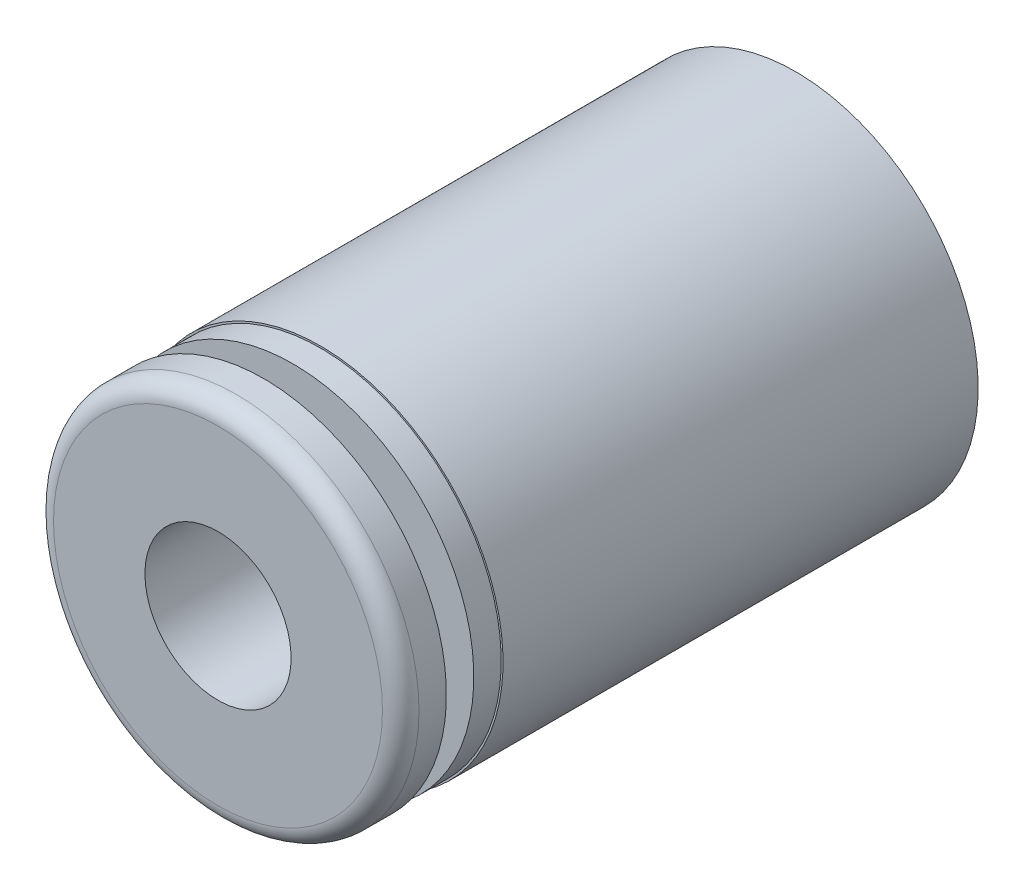
ISO-10303-21;
HEADER;
FILE_DESCRIPTION(('STEP AP214'),'2;1');
FILE_NAME('part.step','',(''),(''),'','','');
FILE_SCHEMA(('AUTOMOTIVE_DESIGN { 1 0 10303 214 1 1 1 1 }'));
ENDSEC;
DATA;
#1=APPLICATION_CONTEXT('core data for automotive mechanical design processes');
#2=APPLICATION_PROTOCOL_DEFINITION('international standard','automotive_design',2000,#1);
#3=PRODUCT_CONTEXT('',#1,'mechanical');
#4=PRODUCT('Part','Part','',(#3));
#5=PRODUCT_RELATED_PRODUCT_CATEGORY('part','',(#4));
#6=PRODUCT_DEFINITION_FORMATION('','',#4);
#7=PRODUCT_DEFINITION_CONTEXT('part definition',#1,'design');
#8=PRODUCT_DEFINITION('design','',#6,#7);
#9=PRODUCT_DEFINITION_SHAPE('','',#8);
#10=(LENGTH_UNIT() NAMED_UNIT(*) SI_UNIT(.MILLI.,.METRE.));
#11=(NAMED_UNIT(*) PLANE_ANGLE_UNIT() SI_UNIT($,.RADIAN.));
#12=(NAMED_UNIT(*) SI_UNIT($,.STERADIAN.) SOLID_ANGLE_UNIT());
#13=UNCERTAINTY_MEASURE_WITH_UNIT(LENGTH_MEASURE(1.E-05),#10,'distance_accuracy_value','');
#14=(GEOMETRIC_REPRESENTATION_CONTEXT(3) GLOBAL_UNCERTAINTY_ASSIGNED_CONTEXT((#13)) GLOBAL_UNIT_ASSIGNED_CONTEXT((#10,
#11,#12)) REPRESENTATION_CONTEXT('',''));
#15=CARTESIAN_POINT('',(0.,0.,0.));
#16=DIRECTION('',(0.,0.,1.));
#17=DIRECTION('',(1.,0.,0.));
#18=AXIS2_PLACEMENT_3D('',#15,#16,#17);
#19=CARTESIAN_POINT('',(0.,0.,14.55));
#20=DIRECTION('',(0.,0.,1.));
#21=DIRECTION('',(1.,0.,0.));
#22=AXIS2_PLACEMENT_3D('',#19,#20,#21);
#23=PLANE('',#22);
#24=CARTESIAN_POINT('',(0.,0.,14.55));
#25=DIRECTION('',(0.,0.,-1.));
#26=DIRECTION('',(-1.,0.,0.));
#27=AXIS2_PLACEMENT_3D('',#24,#25,#26);
#28=CIRCLE('',#27,3.75);
#29=CARTESIAN_POINT('',(-3.75,0.,14.55));
#30=VERTEX_POINT('',#29);
#31=EDGE_CURVE('E88',#30,#30,#28,.T.);
#32=ORIENTED_EDGE('',*,*,#31,.F.);
#33=EDGE_LOOP('',(#32));
#34=FACE_BOUND('',#33,.T.);
#35=CARTESIAN_POINT('',(0.,0.,14.55));
#36=DIRECTION('',(0.,0.,-1.));
#37=DIRECTION('',(-1.,0.,0.));
#38=AXIS2_PLACEMENT_3D('',#35,#36,#37);
#39=CIRCLE('',#38,5.);
#40=CARTESIAN_POINT('',(-5.,0.,14.55));
#41=VERTEX_POINT('',#40);
#42=EDGE_CURVE('E106',#41,#41,#39,.F.);
#43=ORIENTED_EDGE('',*,*,#42,.F.);
#44=EDGE_LOOP('',(#43));
#45=FACE_BOUND('',#44,.T.);
#46=ADVANCED_FACE('F17',(#34,#45),#23,.F.);
#47=CARTESIAN_POINT('',(0.,0.,15.8));
#48=DIRECTION('',(0.,0.,-1.));
#49=DIRECTION('',(-1.,0.,0.));
#50=AXIS2_PLACEMENT_3D('',#47,#48,#49);
#51=CYLINDRICAL_SURFACE('',#50,5.);
#52=CARTESIAN_POINT('',(0.,0.,15.3));
#53=DIRECTION('',(0.,0.,1.));
#54=DIRECTION('',(1.,0.,0.));
#55=AXIS2_PLACEMENT_3D('',#52,#53,#54);
#56=CIRCLE('',#55,5.);
#57=CARTESIAN_POINT('',(5.,0.,15.3));
#58=VERTEX_POINT('',#57);
#59=EDGE_CURVE('E81',#58,#58,#56,.T.);
#60=ORIENTED_EDGE('',*,*,#59,.F.);
#61=EDGE_LOOP('',(#60));
#62=FACE_BOUND('',#61,.T.);
#63=ORIENTED_EDGE('',*,*,#42,.T.);
#64=EDGE_LOOP('',(#63));
#65=FACE_BOUND('',#64,.T.);
#66=ADVANCED_FACE('F110',(#62,#65),#51,.T.);
#67=CARTESIAN_POINT('',(0.,0.,14.55));
#68=DIRECTION('',(0.,0.,-1.));
#69=DIRECTION('',(-1.,0.,0.));
#70=AXIS2_PLACEMENT_3D('',#67,#68,#69);
#71=CYLINDRICAL_SURFACE('',#70,3.75);
#72=CARTESIAN_POINT('',(0.,0.,13.75));
#73=DIRECTION('',(0.,0.,-1.));
#74=DIRECTION('',(-1.,0.,0.));
#75=AXIS2_PLACEMENT_3D('',#72,#73,#74);
#76=CIRCLE('',#75,3.75);
#77=CARTESIAN_POINT('',(-3.75,0.,13.75));
#78=VERTEX_POINT('',#77);
#79=EDGE_CURVE('E41',#78,#78,#76,.T.);
#80=ORIENTED_EDGE('',*,*,#79,.F.);
#81=EDGE_LOOP('',(#80));
#82=FACE_BOUND('',#81,.T.);
#83=ORIENTED_EDGE('',*,*,#31,.T.);
#84=EDGE_LOOP('',(#83));
#85=FACE_BOUND('',#84,.T.);
#86=ADVANCED_FACE('F74',(#82,#85),#71,.T.);
#87=CARTESIAN_POINT('',(0.,0.,15.3));
#88=DIRECTION('',(0.,0.,1.));
#89=DIRECTION('',(1.,0.,0.));
#90=AXIS2_PLACEMENT_3D('',#87,#88,#89);
#91=TOROIDAL_SURFACE('',#90,4.5,0.5);
#92=ORIENTED_EDGE('',*,*,#59,.T.);
#93=EDGE_LOOP('',(#92));
#94=FACE_BOUND('',#93,.T.);
#95=CARTESIAN_POINT('',(0.,0.,15.8));
#96=DIRECTION('',(0.,0.,-1.));
#97=DIRECTION('',(1.,0.,0.));
#98=AXIS2_PLACEMENT_3D('',#95,#96,#97);
#99=CIRCLE('',#98,4.5);
#100=CARTESIAN_POINT('',(-4.5,0.,15.8));
#101=VERTEX_POINT('',#100);
#102=CARTESIAN_POINT('',(4.5,0.,15.8));
#103=VERTEX_POINT('',#102);
#104=EDGE_CURVE('E34',#101,#103,#99,.F.);
#105=ORIENTED_EDGE('',*,*,#104,.F.);
#106=CARTESIAN_POINT('',(0.,0.,15.8));
#107=DIRECTION('',(0.,0.,-1.));
#108=DIRECTION('',(-1.,0.,0.));
#109=AXIS2_PLACEMENT_3D('',#106,#107,#108);
#110=CIRCLE('',#109,4.5);
#111=EDGE_CURVE('E37',#103,#101,#110,.F.);
#112=ORIENTED_EDGE('',*,*,#111,.F.);
#113=EDGE_LOOP('',(#105,#112));
#114=FACE_BOUND('',#113,.T.);
#115=ADVANCED_FACE('F38',(#94,#114),#91,.T.);
#116=CARTESIAN_POINT('',(0.,0.,13.75));
#117=DIRECTION('',(0.,0.,1.));
#118=DIRECTION('',(1.,0.,0.));
#119=AXIS2_PLACEMENT_3D('',#116,#117,#118);
#120=PLANE('',#119);
#121=ORIENTED_EDGE('',*,*,#79,.T.);
#122=EDGE_LOOP('',(#121));
#123=FACE_BOUND('',#122,.T.);
#124=CARTESIAN_POINT('',(0.,0.,13.75));
#125=DIRECTION('',(0.,0.,-1.));
#126=DIRECTION('',(-1.,0.,0.));
#127=AXIS2_PLACEMENT_3D('',#124,#125,#126);
#128=CIRCLE('',#127,4.95);
#129=CARTESIAN_POINT('',(-4.95,0.,13.75));
#130=VERTEX_POINT('',#129);
#131=EDGE_CURVE('E45',#130,#130,#128,.T.);
#132=ORIENTED_EDGE('',*,*,#131,.F.);
#133=EDGE_LOOP('',(#132));
#134=FACE_BOUND('',#133,.T.);
#135=ADVANCED_FACE('F65',(#123,#134),#120,.T.);
#136=CARTESIAN_POINT('',(0.,0.,15.8));
#137=DIRECTION('',(0.,0.,1.));
#138=DIRECTION('',(1.,0.,0.));
#139=AXIS2_PLACEMENT_3D('',#136,#137,#138);
#140=PLANE('',#139);
#141=CARTESIAN_POINT('',(0.,0.,15.8));
#142=DIRECTION('',(0.,0.,-1.));
#143=DIRECTION('',(-1.,0.,0.));
#144=AXIS2_PLACEMENT_3D('',#141,#142,#143);
#145=CIRCLE('',#144,2.);
#146=CARTESIAN_POINT('',(-2.,0.,15.8));
#147=VERTEX_POINT('',#146);
#148=EDGE_CURVE('E98',#147,#147,#145,.T.);
#149=ORIENTED_EDGE('',*,*,#148,.T.);
#150=EDGE_LOOP('',(#149));
#151=FACE_BOUND('',#150,.T.);
#152=ORIENTED_EDGE('',*,*,#111,.T.);
#153=ORIENTED_EDGE('',*,*,#104,.T.);
#154=EDGE_LOOP('',(#152,#153));
#155=FACE_BOUND('',#154,.T.);
#156=ADVANCED_FACE('F44',(#151,#155),#140,.T.);
#157=CARTESIAN_POINT('',(0.,0.,13.75));
#158=DIRECTION('',(0.,0.,-1.));
#159=DIRECTION('',(-1.,0.,0.));
#160=AXIS2_PLACEMENT_3D('',#157,#158,#159);
#161=CYLINDRICAL_SURFACE('',#160,4.95);
#162=CARTESIAN_POINT('',(0.,0.,13.));
#163=DIRECTION('',(0.,0.,-1.));
#164=DIRECTION('',(-1.,0.,0.));
#165=AXIS2_PLACEMENT_3D('',#162,#163,#164);
#166=CIRCLE('',#165,4.95);
#167=CARTESIAN_POINT('',(-4.95,0.,13.));
#168=VERTEX_POINT('',#167);
#169=EDGE_CURVE('E95',#168,#168,#166,.T.);
#170=ORIENTED_EDGE('',*,*,#169,.F.);
#171=EDGE_LOOP('',(#170));
#172=FACE_BOUND('',#171,.T.);
#173=ORIENTED_EDGE('',*,*,#131,.T.);
#174=EDGE_LOOP('',(#173));
#175=FACE_BOUND('',#174,.T.);
#176=ADVANCED_FACE('F64',(#172,#175),#161,.T.);
#177=CARTESIAN_POINT('',(0.,0.,13.));
#178=DIRECTION('',(0.,0.,-1.));
#179=DIRECTION('',(-1.,0.,0.));
#180=AXIS2_PLACEMENT_3D('',#177,#178,#179);
#181=CYLINDRICAL_SURFACE('',#180,2.);
#182=CARTESIAN_POINT('',(0.,0.,0.));
#183=DIRECTION('',(0.,0.,-1.));
#184=DIRECTION('',(-1.,0.,0.));
#185=AXIS2_PLACEMENT_3D('',#182,#183,#184);
#186=CIRCLE('',#185,2.);
#187=CARTESIAN_POINT('',(-2.,0.,0.));
#188=VERTEX_POINT('',#187);
#189=EDGE_CURVE('E92',#188,#188,#186,.T.);
#190=ORIENTED_EDGE('',*,*,#189,.T.);
#191=EDGE_LOOP('',(#190));
#192=FACE_BOUND('',#191,.T.);
#193=ORIENTED_EDGE('',*,*,#148,.F.);
#194=EDGE_LOOP('',(#193));
#195=FACE_BOUND('',#194,.T.);
#196=ADVANCED_FACE('F134',(#192,#195),#181,.F.);
#197=CARTESIAN_POINT('',(0.,0.,13.));
#198=DIRECTION('',(0.,0.,1.));
#199=DIRECTION('',(1.,0.,0.));
#200=AXIS2_PLACEMENT_3D('',#197,#198,#199);
#201=PLANE('',#200);
#202=ORIENTED_EDGE('',*,*,#169,.T.);
#203=EDGE_LOOP('',(#202));
#204=FACE_BOUND('',#203,.T.);
#205=CARTESIAN_POINT('',(0.,0.,13.));
#206=DIRECTION('',(0.,0.,-1.));
#207=DIRECTION('',(-1.,0.,0.));
#208=AXIS2_PLACEMENT_3D('',#205,#206,#207);
#209=CIRCLE('',#208,5.);
#210=CARTESIAN_POINT('',(-5.,0.,13.));
#211=VERTEX_POINT('',#210);
#212=EDGE_CURVE('E27',#211,#211,#209,.T.);
#213=ORIENTED_EDGE('',*,*,#212,.F.);
#214=EDGE_LOOP('',(#213));
#215=FACE_BOUND('',#214,.T.);
#216=ADVANCED_FACE('F128',(#204,#215),#201,.T.);
#217=CARTESIAN_POINT('',(0.,0.,0.));
#218=DIRECTION('',(0.,0.,1.));
#219=DIRECTION('',(1.,0.,0.));
#220=AXIS2_PLACEMENT_3D('',#217,#218,#219);
#221=PLANE('',#220);
#222=ORIENTED_EDGE('',*,*,#189,.F.);
#223=EDGE_LOOP('',(#222));
#224=FACE_BOUND('',#223,.T.);
#225=CARTESIAN_POINT('',(0.,0.,0.));
#226=DIRECTION('',(0.,0.,-1.));
#227=DIRECTION('',(-1.,0.,0.));
#228=AXIS2_PLACEMENT_3D('',#225,#226,#227);
#229=CIRCLE('',#228,5.);
#230=CARTESIAN_POINT('',(-5.,0.,0.));
#231=VERTEX_POINT('',#230);
#232=EDGE_CURVE('E11',#231,#231,#229,.F.);
#233=ORIENTED_EDGE('',*,*,#232,.F.);
#234=EDGE_LOOP('',(#233));
#235=FACE_BOUND('',#234,.T.);
#236=ADVANCED_FACE('F122',(#224,#235),#221,.F.);
#237=CARTESIAN_POINT('',(0.,0.,13.));
#238=DIRECTION('',(0.,0.,-1.));
#239=DIRECTION('',(-1.,0.,0.));
#240=AXIS2_PLACEMENT_3D('',#237,#238,#239);
#241=CYLINDRICAL_SURFACE('',#240,5.);
#242=ORIENTED_EDGE('',*,*,#232,.T.);
#243=EDGE_LOOP('',(#242));
#244=FACE_BOUND('',#243,.T.);
#245=ORIENTED_EDGE('',*,*,#212,.T.);
#246=EDGE_LOOP('',(#245));
#247=FACE_BOUND('',#246,.T.);
#248=ADVANCED_FACE('F120',(#244,#247),#241,.T.);
#249=CLOSED_SHELL('',(#46,#66,#86,#115,#135,#156,#176,#196,#216,#236,#248));
#250=MANIFOLD_SOLID_BREP('B1',#249);
#251=ADVANCED_BREP_SHAPE_REPRESENTATION('',(#18,#250),#14);
#252=SHAPE_DEFINITION_REPRESENTATION(#9,#251);
ENDSEC;
END-ISO-10303-21;
